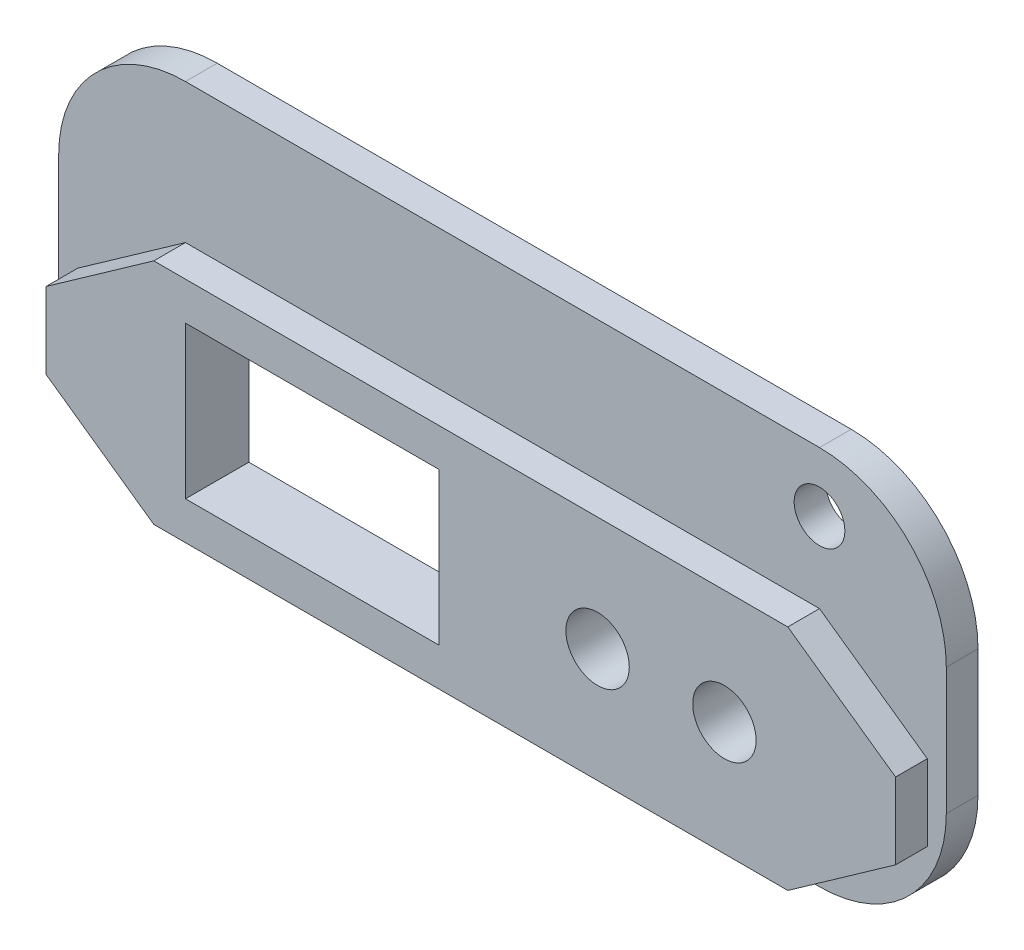
ISO-10303-21;
HEADER;
FILE_DESCRIPTION(('STEP AP214'),'2;1');
FILE_NAME('part.step','',(''),(''),'','','');
FILE_SCHEMA(('AUTOMOTIVE_DESIGN { 1 0 10303 214 1 1 1 1 }'));
ENDSEC;
DATA;
#1=APPLICATION_CONTEXT('core data for automotive mechanical design processes');
#2=APPLICATION_PROTOCOL_DEFINITION('international standard','automotive_design',2000,#1);
#3=PRODUCT_CONTEXT('',#1,'mechanical');
#4=PRODUCT('Part','Part','',(#3));
#5=PRODUCT_RELATED_PRODUCT_CATEGORY('part','',(#4));
#6=PRODUCT_DEFINITION_FORMATION('','',#4);
#7=PRODUCT_DEFINITION_CONTEXT('part definition',#1,'design');
#8=PRODUCT_DEFINITION('design','',#6,#7);
#9=PRODUCT_DEFINITION_SHAPE('','',#8);
#10=(LENGTH_UNIT() NAMED_UNIT(*) SI_UNIT(.MILLI.,.METRE.));
#11=(NAMED_UNIT(*) PLANE_ANGLE_UNIT() SI_UNIT($,.RADIAN.));
#12=(NAMED_UNIT(*) SI_UNIT($,.STERADIAN.) SOLID_ANGLE_UNIT());
#13=UNCERTAINTY_MEASURE_WITH_UNIT(LENGTH_MEASURE(1.E-05),#10,'distance_accuracy_value','');
#14=(GEOMETRIC_REPRESENTATION_CONTEXT(3) GLOBAL_UNCERTAINTY_ASSIGNED_CONTEXT((#13)) GLOBAL_UNIT_ASSIGNED_CONTEXT((#10,
#11,#12)) REPRESENTATION_CONTEXT('',''));
#15=CARTESIAN_POINT('',(0.,0.,0.));
#16=DIRECTION('',(0.,0.,1.));
#17=DIRECTION('',(1.,0.,0.));
#18=AXIS2_PLACEMENT_3D('',#15,#16,#17);
#19=CARTESIAN_POINT('',(-33.5,3.,2.5));
#20=DIRECTION('',(1.,0.,0.));
#21=DIRECTION('',(0.,1.,0.));
#22=AXIS2_PLACEMENT_3D('',#19,#20,#21);
#23=PLANE('',#22);
#24=DIRECTION('',(0.,-1.,0.));
#25=VECTOR('',#24,1.);
#26=CARTESIAN_POINT('',(-33.5,3.,0.));
#27=LINE('',#26,#25);
#28=CARTESIAN_POINT('',(-33.5,3.,0.));
#29=VERTEX_POINT('',#28);
#30=CARTESIAN_POINT('',(-33.5,-3.,0.));
#31=VERTEX_POINT('',#30);
#32=EDGE_CURVE('E268',#29,#31,#27,.T.);
#33=ORIENTED_EDGE('',*,*,#32,.T.);
#34=DIRECTION('',(0.,0.,-1.));
#35=VECTOR('',#34,1.);
#36=CARTESIAN_POINT('',(-33.5,-3.,2.5));
#37=LINE('',#36,#35);
#38=CARTESIAN_POINT('',(-33.5,-3.,2.5));
#39=VERTEX_POINT('',#38);
#40=EDGE_CURVE('E367',#39,#31,#37,.T.);
#41=ORIENTED_EDGE('',*,*,#40,.F.);
#42=DIRECTION('',(0.,-1.,0.));
#43=VECTOR('',#42,1.);
#44=CARTESIAN_POINT('',(-33.5,3.,2.5));
#45=LINE('',#44,#43);
#46=CARTESIAN_POINT('',(-33.5,3.,2.5));
#47=VERTEX_POINT('',#46);
#48=EDGE_CURVE('E283',#47,#39,#45,.T.);
#49=ORIENTED_EDGE('',*,*,#48,.F.);
#50=DIRECTION('',(0.,0.,-1.));
#51=VECTOR('',#50,1.);
#52=CARTESIAN_POINT('',(-33.5,3.,2.5));
#53=LINE('',#52,#51);
#54=EDGE_CURVE('E309',#47,#29,#53,.T.);
#55=ORIENTED_EDGE('',*,*,#54,.T.);
#56=EDGE_LOOP('',(#33,#41,#49,#55));
#57=FACE_BOUND('',#56,.T.);
#58=ADVANCED_FACE('F42',(#57),#23,.F.);
#59=CARTESIAN_POINT('',(-33.5,-3.,2.5));
#60=DIRECTION('',(0.576683197598655,0.816967863264762,0.));
#61=DIRECTION('',(-0.816967863264762,0.576683197598655,0.));
#62=AXIS2_PLACEMENT_3D('',#59,#60,#61);
#63=PLANE('',#62);
#64=DIRECTION('',(0.816967863264762,-0.576683197598655,0.));
#65=VECTOR('',#64,1.);
#66=CARTESIAN_POINT('',(-33.5,-3.,0.));
#67=LINE('',#66,#65);
#68=CARTESIAN_POINT('',(-25.,-9.,0.));
#69=VERTEX_POINT('',#68);
#70=EDGE_CURVE('E313',#31,#69,#67,.T.);
#71=ORIENTED_EDGE('',*,*,#70,.T.);
#72=DIRECTION('',(0.,0.,-1.));
#73=VECTOR('',#72,1.);
#74=CARTESIAN_POINT('',(-25.,-9.,2.5));
#75=LINE('',#74,#73);
#76=CARTESIAN_POINT('',(-25.,-9.,2.5));
#77=VERTEX_POINT('',#76);
#78=EDGE_CURVE('E363',#77,#69,#75,.T.);
#79=ORIENTED_EDGE('',*,*,#78,.F.);
#80=DIRECTION('',(0.816967863264762,-0.576683197598655,0.));
#81=VECTOR('',#80,1.);
#82=CARTESIAN_POINT('',(-33.5,-3.,2.5));
#83=LINE('',#82,#81);
#84=EDGE_CURVE('E287',#39,#77,#83,.T.);
#85=ORIENTED_EDGE('',*,*,#84,.F.);
#86=ORIENTED_EDGE('',*,*,#40,.T.);
#87=EDGE_LOOP('',(#71,#79,#85,#86));
#88=FACE_BOUND('',#87,.T.);
#89=ADVANCED_FACE('F467',(#88),#63,.F.);
#90=CARTESIAN_POINT('',(-25.,-9.,2.5));
#91=DIRECTION('',(0.,1.,0.));
#92=DIRECTION('',(0.,0.,1.));
#93=AXIS2_PLACEMENT_3D('',#90,#91,#92);
#94=PLANE('',#93);
#95=DIRECTION('',(1.,0.,0.));
#96=VECTOR('',#95,1.);
#97=CARTESIAN_POINT('',(-25.,-9.,0.));
#98=LINE('',#97,#96);
#99=CARTESIAN_POINT('',(25.,-9.,0.));
#100=VERTEX_POINT('',#99);
#101=EDGE_CURVE('E317',#69,#100,#98,.T.);
#102=ORIENTED_EDGE('',*,*,#101,.T.);
#103=DIRECTION('',(0.,0.,-1.));
#104=VECTOR('',#103,1.);
#105=CARTESIAN_POINT('',(25.,-9.,2.5));
#106=LINE('',#105,#104);
#107=CARTESIAN_POINT('',(25.,-9.,2.5));
#108=VERTEX_POINT('',#107);
#109=EDGE_CURVE('E359',#108,#100,#106,.T.);
#110=ORIENTED_EDGE('',*,*,#109,.F.);
#111=DIRECTION('',(1.,0.,0.));
#112=VECTOR('',#111,1.);
#113=CARTESIAN_POINT('',(-25.,-9.,2.5));
#114=LINE('',#113,#112);
#115=EDGE_CURVE('E291',#77,#108,#114,.T.);
#116=ORIENTED_EDGE('',*,*,#115,.F.);
#117=ORIENTED_EDGE('',*,*,#78,.T.);
#118=EDGE_LOOP('',(#102,#110,#116,#117));
#119=FACE_BOUND('',#118,.T.);
#120=ADVANCED_FACE('F473',(#119),#94,.F.);
#121=CARTESIAN_POINT('',(25.,-9.,2.5));
#122=DIRECTION('',(-0.576683197598656,0.816967863264762,0.));
#123=DIRECTION('',(-0.816967863264762,-0.576683197598656,0.));
#124=AXIS2_PLACEMENT_3D('',#121,#122,#123);
#125=PLANE('',#124);
#126=DIRECTION('',(0.816967863264762,0.576683197598656,0.));
#127=VECTOR('',#126,1.);
#128=CARTESIAN_POINT('',(25.,-9.,0.));
#129=LINE('',#128,#127);
#130=CARTESIAN_POINT('',(33.5,-3.,0.));
#131=VERTEX_POINT('',#130);
#132=EDGE_CURVE('E321',#100,#131,#129,.T.);
#133=ORIENTED_EDGE('',*,*,#132,.T.);
#134=DIRECTION('',(0.,0.,-1.));
#135=VECTOR('',#134,1.);
#136=CARTESIAN_POINT('',(33.5,-3.,2.5));
#137=LINE('',#136,#135);
#138=CARTESIAN_POINT('',(33.5,-3.,2.5));
#139=VERTEX_POINT('',#138);
#140=EDGE_CURVE('E355',#139,#131,#137,.T.);
#141=ORIENTED_EDGE('',*,*,#140,.F.);
#142=DIRECTION('',(0.816967863264762,0.576683197598656,0.));
#143=VECTOR('',#142,1.);
#144=CARTESIAN_POINT('',(25.,-9.,2.5));
#145=LINE('',#144,#143);
#146=EDGE_CURVE('E294',#108,#139,#145,.T.);
#147=ORIENTED_EDGE('',*,*,#146,.F.);
#148=ORIENTED_EDGE('',*,*,#109,.T.);
#149=EDGE_LOOP('',(#133,#141,#147,#148));
#150=FACE_BOUND('',#149,.T.);
#151=ADVANCED_FACE('F680',(#150),#125,.F.);
#152=CARTESIAN_POINT('',(33.5,3.,2.5));
#153=DIRECTION('',(-1.,0.,0.));
#154=DIRECTION('',(0.,0.,1.));
#155=AXIS2_PLACEMENT_3D('',#152,#153,#154);
#156=PLANE('',#155);
#157=DIRECTION('',(0.,1.,0.));
#158=VECTOR('',#157,1.);
#159=CARTESIAN_POINT('',(33.5,3.,0.));
#160=LINE('',#159,#158);
#161=CARTESIAN_POINT('',(33.5,3.,0.));
#162=VERTEX_POINT('',#161);
#163=EDGE_CURVE('E325',#131,#162,#160,.T.);
#164=ORIENTED_EDGE('',*,*,#163,.T.);
#165=DIRECTION('',(0.,0.,-1.));
#166=VECTOR('',#165,1.);
#167=CARTESIAN_POINT('',(33.5,3.,2.5));
#168=LINE('',#167,#166);
#169=CARTESIAN_POINT('',(33.5,3.,2.5));
#170=VERTEX_POINT('',#169);
#171=EDGE_CURVE('E351',#170,#162,#168,.T.);
#172=ORIENTED_EDGE('',*,*,#171,.F.);
#173=DIRECTION('',(0.,1.,0.));
#174=VECTOR('',#173,1.);
#175=CARTESIAN_POINT('',(33.5,3.,2.5));
#176=LINE('',#175,#174);
#177=EDGE_CURVE('E297',#139,#170,#176,.T.);
#178=ORIENTED_EDGE('',*,*,#177,.F.);
#179=ORIENTED_EDGE('',*,*,#140,.T.);
#180=EDGE_LOOP('',(#164,#172,#178,#179));
#181=FACE_BOUND('',#180,.T.);
#182=ADVANCED_FACE('F670',(#181),#156,.F.);
#183=CARTESIAN_POINT('',(25.,9.,2.5));
#184=DIRECTION('',(-0.576683197598656,-0.816967863264761,0.));
#185=DIRECTION('',(0.816967863264761,-0.576683197598656,0.));
#186=AXIS2_PLACEMENT_3D('',#183,#184,#185);
#187=PLANE('',#186);
#188=DIRECTION('',(-0.816967863264761,0.576683197598656,0.));
#189=VECTOR('',#188,1.);
#190=CARTESIAN_POINT('',(25.,9.,0.));
#191=LINE('',#190,#189);
#192=CARTESIAN_POINT('',(25.,9.,0.));
#193=VERTEX_POINT('',#192);
#194=EDGE_CURVE('E329',#162,#193,#191,.T.);
#195=ORIENTED_EDGE('',*,*,#194,.T.);
#196=DIRECTION('',(0.,0.,-1.));
#197=VECTOR('',#196,1.);
#198=CARTESIAN_POINT('',(25.,9.,2.5));
#199=LINE('',#198,#197);
#200=CARTESIAN_POINT('',(25.,9.,2.5));
#201=VERTEX_POINT('',#200);
#202=EDGE_CURVE('E347',#201,#193,#199,.T.);
#203=ORIENTED_EDGE('',*,*,#202,.F.);
#204=DIRECTION('',(-0.816967863264761,0.576683197598656,0.));
#205=VECTOR('',#204,1.);
#206=CARTESIAN_POINT('',(25.,9.,2.5));
#207=LINE('',#206,#205);
#208=EDGE_CURVE('E300',#170,#201,#207,.T.);
#209=ORIENTED_EDGE('',*,*,#208,.F.);
#210=ORIENTED_EDGE('',*,*,#171,.T.);
#211=EDGE_LOOP('',(#195,#203,#209,#210));
#212=FACE_BOUND('',#211,.T.);
#213=ADVANCED_FACE('F660',(#212),#187,.F.);
#214=CARTESIAN_POINT('',(-25.,9.,2.5));
#215=DIRECTION('',(0.,-1.,0.));
#216=DIRECTION('',(1.,0.,0.));
#217=AXIS2_PLACEMENT_3D('',#214,#215,#216);
#218=PLANE('',#217);
#219=DIRECTION('',(-1.,0.,0.));
#220=VECTOR('',#219,1.);
#221=CARTESIAN_POINT('',(-25.,9.,0.));
#222=LINE('',#221,#220);
#223=CARTESIAN_POINT('',(-25.,9.,0.));
#224=VERTEX_POINT('',#223);
#225=EDGE_CURVE('E333',#193,#224,#222,.T.);
#226=ORIENTED_EDGE('',*,*,#225,.T.);
#227=DIRECTION('',(0.,0.,-1.));
#228=VECTOR('',#227,1.);
#229=CARTESIAN_POINT('',(-25.,9.,2.5));
#230=LINE('',#229,#228);
#231=CARTESIAN_POINT('',(-25.,9.,2.5));
#232=VERTEX_POINT('',#231);
#233=EDGE_CURVE('E343',#232,#224,#230,.T.);
#234=ORIENTED_EDGE('',*,*,#233,.F.);
#235=DIRECTION('',(-1.,0.,0.));
#236=VECTOR('',#235,1.);
#237=CARTESIAN_POINT('',(-25.,9.,2.5));
#238=LINE('',#237,#236);
#239=EDGE_CURVE('E303',#201,#232,#238,.T.);
#240=ORIENTED_EDGE('',*,*,#239,.F.);
#241=ORIENTED_EDGE('',*,*,#202,.T.);
#242=EDGE_LOOP('',(#226,#234,#240,#241));
#243=FACE_BOUND('',#242,.T.);
#244=ADVANCED_FACE('F650',(#243),#218,.F.);
#245=CARTESIAN_POINT('',(-33.5,3.,2.5));
#246=DIRECTION('',(0.576683197598655,-0.816967863264762,0.));
#247=DIRECTION('',(0.816967863264762,0.576683197598655,0.));
#248=AXIS2_PLACEMENT_3D('',#245,#246,#247);
#249=PLANE('',#248);
#250=DIRECTION('',(-0.816967863264762,-0.576683197598655,0.));
#251=VECTOR('',#250,1.);
#252=CARTESIAN_POINT('',(-33.5,3.,0.));
#253=LINE('',#252,#251);
#254=EDGE_CURVE('E288',#224,#29,#253,.T.);
#255=ORIENTED_EDGE('',*,*,#254,.T.);
#256=ORIENTED_EDGE('',*,*,#54,.F.);
#257=DIRECTION('',(-0.816967863264762,-0.576683197598655,0.));
#258=VECTOR('',#257,1.);
#259=CARTESIAN_POINT('',(-33.5,3.,2.5));
#260=LINE('',#259,#258);
#261=EDGE_CURVE('E306',#232,#47,#260,.T.);
#262=ORIENTED_EDGE('',*,*,#261,.F.);
#263=ORIENTED_EDGE('',*,*,#233,.T.);
#264=EDGE_LOOP('',(#255,#256,#262,#263));
#265=FACE_BOUND('',#264,.T.);
#266=ADVANCED_FACE('F507',(#265),#249,.F.);
#267=CARTESIAN_POINT('',(0.,0.,2.5));
#268=DIRECTION('',(0.,0.,1.));
#269=DIRECTION('',(1.,0.,0.));
#270=AXIS2_PLACEMENT_3D('',#267,#268,#269);
#271=PLANE('',#270);
#272=DIRECTION('',(0.,1.,0.));
#273=VECTOR('',#272,1.);
#274=CARTESIAN_POINT('',(-2.5,6.,2.5));
#275=LINE('',#274,#273);
#276=CARTESIAN_POINT('',(-2.5,-6.,2.5));
#277=VERTEX_POINT('',#276);
#278=CARTESIAN_POINT('',(-2.5,6.,2.5));
#279=VERTEX_POINT('',#278);
#280=EDGE_CURVE('E58',#277,#279,#275,.T.);
#281=ORIENTED_EDGE('',*,*,#280,.F.);
#282=DIRECTION('',(1.,0.,0.));
#283=VECTOR('',#282,1.);
#284=CARTESIAN_POINT('',(-22.5,-6.,2.5));
#285=LINE('',#284,#283);
#286=CARTESIAN_POINT('',(-22.5,-6.,2.5));
#287=VERTEX_POINT('',#286);
#288=EDGE_CURVE('E199',#287,#277,#285,.T.);
#289=ORIENTED_EDGE('',*,*,#288,.F.);
#290=DIRECTION('',(0.,-1.,0.));
#291=VECTOR('',#290,1.);
#292=CARTESIAN_POINT('',(-22.5,6.,2.5));
#293=LINE('',#292,#291);
#294=CARTESIAN_POINT('',(-22.5,6.,2.5));
#295=VERTEX_POINT('',#294);
#296=EDGE_CURVE('E181',#295,#287,#293,.T.);
#297=ORIENTED_EDGE('',*,*,#296,.F.);
#298=DIRECTION('',(-1.,0.,0.));
#299=VECTOR('',#298,1.);
#300=CARTESIAN_POINT('',(-22.5,6.,2.5));
#301=LINE('',#300,#299);
#302=EDGE_CURVE('E191',#279,#295,#301,.T.);
#303=ORIENTED_EDGE('',*,*,#302,.F.);
#304=EDGE_LOOP('',(#281,#289,#297,#303));
#305=FACE_BOUND('',#304,.T.);
#306=CARTESIAN_POINT('',(10.,0.,2.5));
#307=DIRECTION('',(0.,0.,1.));
#308=DIRECTION('',(1.,0.,0.));
#309=AXIS2_PLACEMENT_3D('',#306,#307,#308);
#310=CIRCLE('',#309,2.5);
#311=CARTESIAN_POINT('',(12.5,0.,2.5));
#312=VERTEX_POINT('',#311);
#313=EDGE_CURVE('E231',#312,#312,#310,.T.);
#314=ORIENTED_EDGE('',*,*,#313,.F.);
#315=EDGE_LOOP('',(#314));
#316=FACE_BOUND('',#315,.T.);
#317=CARTESIAN_POINT('',(20.,0.,2.5));
#318=DIRECTION('',(0.,0.,1.));
#319=DIRECTION('',(1.,0.,0.));
#320=AXIS2_PLACEMENT_3D('',#317,#318,#319);
#321=CIRCLE('',#320,2.5);
#322=CARTESIAN_POINT('',(22.5,0.,2.5));
#323=VERTEX_POINT('',#322);
#324=EDGE_CURVE('E232',#323,#323,#321,.T.);
#325=ORIENTED_EDGE('',*,*,#324,.F.);
#326=EDGE_LOOP('',(#325));
#327=FACE_BOUND('',#326,.T.);
#328=ORIENTED_EDGE('',*,*,#48,.T.);
#329=ORIENTED_EDGE('',*,*,#84,.T.);
#330=ORIENTED_EDGE('',*,*,#115,.T.);
#331=ORIENTED_EDGE('',*,*,#146,.T.);
#332=ORIENTED_EDGE('',*,*,#177,.T.);
#333=ORIENTED_EDGE('',*,*,#208,.T.);
#334=ORIENTED_EDGE('',*,*,#239,.T.);
#335=ORIENTED_EDGE('',*,*,#261,.T.);
#336=EDGE_LOOP('',(#328,#329,#330,#331,#332,#333,#334,#335));
#337=FACE_BOUND('',#336,.T.);
#338=ADVANCED_FACE('F196',(#305,#316,#327,#337),#271,.T.);
#339=CARTESIAN_POINT('',(0.,0.,0.));
#340=DIRECTION('',(0.,0.,1.));
#341=DIRECTION('',(1.,0.,0.));
#342=AXIS2_PLACEMENT_3D('',#339,#340,#341);
#343=PLANE('',#342);
#344=CARTESIAN_POINT('',(25.,15.3,0.));
#345=DIRECTION('',(0.,0.,1.));
#346=DIRECTION('',(1.,0.,0.));
#347=AXIS2_PLACEMENT_3D('',#344,#345,#346);
#348=CIRCLE('',#347,2.);
#349=CARTESIAN_POINT('',(27.,15.3,0.));
#350=VERTEX_POINT('',#349);
#351=EDGE_CURVE('E222',#350,#350,#348,.T.);
#352=ORIENTED_EDGE('',*,*,#351,.F.);
#353=EDGE_LOOP('',(#352));
#354=FACE_BOUND('',#353,.T.);
#355=DIRECTION('',(0.,-1.,0.));
#356=VECTOR('',#355,1.);
#357=CARTESIAN_POINT('',(-35.,20.,0.));
#358=LINE('',#357,#356);
#359=CARTESIAN_POINT('',(-35.,10.,0.));
#360=VERTEX_POINT('',#359);
#361=CARTESIAN_POINT('',(-35.,0.,0.));
#362=VERTEX_POINT('',#361);
#363=EDGE_CURVE('E276',#360,#362,#358,.T.);
#364=ORIENTED_EDGE('',*,*,#363,.T.);
#365=CARTESIAN_POINT('',(-25.,0.,0.));
#366=DIRECTION('',(0.,0.,1.));
#367=DIRECTION('',(1.,0.,0.));
#368=AXIS2_PLACEMENT_3D('',#365,#366,#367);
#369=CIRCLE('',#368,10.);
#370=CARTESIAN_POINT('',(-25.,-10.,0.));
#371=VERTEX_POINT('',#370);
#372=EDGE_CURVE('E387',#362,#371,#369,.T.);
#373=ORIENTED_EDGE('',*,*,#372,.T.);
#374=DIRECTION('',(1.,0.,0.));
#375=VECTOR('',#374,1.);
#376=CARTESIAN_POINT('',(-35.,-10.,0.));
#377=LINE('',#376,#375);
#378=CARTESIAN_POINT('',(25.,-10.,0.));
#379=VERTEX_POINT('',#378);
#380=EDGE_CURVE('E256',#371,#379,#377,.T.);
#381=ORIENTED_EDGE('',*,*,#380,.T.);
#382=CARTESIAN_POINT('',(25.,0.,0.));
#383=DIRECTION('',(0.,0.,1.));
#384=DIRECTION('',(1.,0.,0.));
#385=AXIS2_PLACEMENT_3D('',#382,#383,#384);
#386=CIRCLE('',#385,10.);
#387=CARTESIAN_POINT('',(35.,0.,0.));
#388=VERTEX_POINT('',#387);
#389=EDGE_CURVE('E384',#379,#388,#386,.T.);
#390=ORIENTED_EDGE('',*,*,#389,.T.);
#391=DIRECTION('',(0.,1.,0.));
#392=VECTOR('',#391,1.);
#393=CARTESIAN_POINT('',(35.,20.,0.));
#394=LINE('',#393,#392);
#395=CARTESIAN_POINT('',(35.,10.,0.));
#396=VERTEX_POINT('',#395);
#397=EDGE_CURVE('E247',#388,#396,#394,.T.);
#398=ORIENTED_EDGE('',*,*,#397,.T.);
#399=CARTESIAN_POINT('',(25.,10.,0.));
#400=DIRECTION('',(0.,0.,1.));
#401=DIRECTION('',(1.,0.,0.));
#402=AXIS2_PLACEMENT_3D('',#399,#400,#401);
#403=CIRCLE('',#402,10.);
#404=CARTESIAN_POINT('',(25.,20.,0.));
#405=VERTEX_POINT('',#404);
#406=EDGE_CURVE('E381',#396,#405,#403,.T.);
#407=ORIENTED_EDGE('',*,*,#406,.T.);
#408=DIRECTION('',(-1.,0.,0.));
#409=VECTOR('',#408,1.);
#410=CARTESIAN_POINT('',(-35.,20.,0.));
#411=LINE('',#410,#409);
#412=CARTESIAN_POINT('',(-25.,20.,0.));
#413=VERTEX_POINT('',#412);
#414=EDGE_CURVE('E272',#405,#413,#411,.T.);
#415=ORIENTED_EDGE('',*,*,#414,.T.);
#416=CARTESIAN_POINT('',(-25.,10.,0.));
#417=DIRECTION('',(0.,0.,1.));
#418=DIRECTION('',(1.,0.,0.));
#419=AXIS2_PLACEMENT_3D('',#416,#417,#418);
#420=CIRCLE('',#419,10.);
#421=EDGE_CURVE('E378',#413,#360,#420,.T.);
#422=ORIENTED_EDGE('',*,*,#421,.T.);
#423=EDGE_LOOP('',(#364,#373,#381,#390,#398,#407,#415,#422));
#424=FACE_BOUND('',#423,.T.);
#425=ORIENTED_EDGE('',*,*,#32,.F.);
#426=ORIENTED_EDGE('',*,*,#254,.F.);
#427=ORIENTED_EDGE('',*,*,#225,.F.);
#428=ORIENTED_EDGE('',*,*,#194,.F.);
#429=ORIENTED_EDGE('',*,*,#163,.F.);
#430=ORIENTED_EDGE('',*,*,#132,.F.);
#431=ORIENTED_EDGE('',*,*,#101,.F.);
#432=ORIENTED_EDGE('',*,*,#70,.F.);
#433=EDGE_LOOP('',(#425,#426,#427,#428,#429,#430,#431,#432));
#434=FACE_BOUND('',#433,.T.);
#435=ADVANCED_FACE('F426',(#354,#424,#434),#343,.T.);
#436=CARTESIAN_POINT('',(35.,20.,-2.5));
#437=DIRECTION('',(1.,0.,0.));
#438=DIRECTION('',(0.,1.,0.));
#439=AXIS2_PLACEMENT_3D('',#436,#437,#438);
#440=PLANE('',#439);
#441=ORIENTED_EDGE('',*,*,#397,.F.);
#442=DIRECTION('',(0.,0.,1.));
#443=VECTOR('',#442,1.);
#444=CARTESIAN_POINT('',(35.,0.,-2.5));
#445=LINE('',#444,#443);
#446=CARTESIAN_POINT('',(35.,0.,-2.5));
#447=VERTEX_POINT('',#446);
#448=EDGE_CURVE('E413',#388,#447,#445,.F.);
#449=ORIENTED_EDGE('',*,*,#448,.T.);
#450=DIRECTION('',(0.,1.,0.));
#451=VECTOR('',#450,1.);
#452=CARTESIAN_POINT('',(35.,20.,-2.5));
#453=LINE('',#452,#451);
#454=CARTESIAN_POINT('',(35.,10.,-2.5));
#455=VERTEX_POINT('',#454);
#456=EDGE_CURVE('E251',#447,#455,#453,.T.);
#457=ORIENTED_EDGE('',*,*,#456,.T.);
#458=DIRECTION('',(0.,0.,1.));
#459=VECTOR('',#458,1.);
#460=CARTESIAN_POINT('',(35.,10.,-2.5));
#461=LINE('',#460,#459);
#462=EDGE_CURVE('E409',#455,#396,#461,.T.);
#463=ORIENTED_EDGE('',*,*,#462,.T.);
#464=EDGE_LOOP('',(#441,#449,#457,#463));
#465=FACE_BOUND('',#464,.T.);
#466=ADVANCED_FACE('F435',(#465),#440,.T.);
#467=CARTESIAN_POINT('',(-35.,-10.,-2.5));
#468=DIRECTION('',(0.,-1.,0.));
#469=DIRECTION('',(1.,0.,0.));
#470=AXIS2_PLACEMENT_3D('',#467,#468,#469);
#471=PLANE('',#470);
#472=ORIENTED_EDGE('',*,*,#380,.F.);
#473=DIRECTION('',(0.,0.,1.));
#474=VECTOR('',#473,1.);
#475=CARTESIAN_POINT('',(-25.,-10.,-2.5));
#476=LINE('',#475,#474);
#477=CARTESIAN_POINT('',(-25.,-10.,-2.5));
#478=VERTEX_POINT('',#477);
#479=EDGE_CURVE('E394',#371,#478,#476,.F.);
#480=ORIENTED_EDGE('',*,*,#479,.T.);
#481=DIRECTION('',(1.,0.,0.));
#482=VECTOR('',#481,1.);
#483=CARTESIAN_POINT('',(-35.,-10.,-2.5));
#484=LINE('',#483,#482);
#485=CARTESIAN_POINT('',(25.,-10.,-2.5));
#486=VERTEX_POINT('',#485);
#487=EDGE_CURVE('E264',#478,#486,#484,.T.);
#488=ORIENTED_EDGE('',*,*,#487,.T.);
#489=DIRECTION('',(0.,0.,1.));
#490=VECTOR('',#489,1.);
#491=CARTESIAN_POINT('',(25.,-10.,-2.5));
#492=LINE('',#491,#490);
#493=EDGE_CURVE('E390',#486,#379,#492,.T.);
#494=ORIENTED_EDGE('',*,*,#493,.T.);
#495=EDGE_LOOP('',(#472,#480,#488,#494));
#496=FACE_BOUND('',#495,.T.);
#497=ADVANCED_FACE('F447',(#496),#471,.T.);
#498=CARTESIAN_POINT('',(-35.,20.,-2.5));
#499=DIRECTION('',(-1.,0.,0.));
#500=DIRECTION('',(0.,0.,1.));
#501=AXIS2_PLACEMENT_3D('',#498,#499,#500);
#502=PLANE('',#501);
#503=DIRECTION('',(0.,-1.,0.));
#504=VECTOR('',#503,1.);
#505=CARTESIAN_POINT('',(-35.,20.,-2.5));
#506=LINE('',#505,#504);
#507=CARTESIAN_POINT('',(-35.,10.,-2.5));
#508=VERTEX_POINT('',#507);
#509=CARTESIAN_POINT('',(-35.,0.,-2.5));
#510=VERTEX_POINT('',#509);
#511=EDGE_CURVE('E260',#508,#510,#506,.T.);
#512=ORIENTED_EDGE('',*,*,#511,.T.);
#513=DIRECTION('',(0.,0.,1.));
#514=VECTOR('',#513,1.);
#515=CARTESIAN_POINT('',(-35.,0.,-2.5));
#516=LINE('',#515,#514);
#517=EDGE_CURVE('E374',#510,#362,#516,.T.);
#518=ORIENTED_EDGE('',*,*,#517,.T.);
#519=ORIENTED_EDGE('',*,*,#363,.F.);
#520=DIRECTION('',(0.,0.,1.));
#521=VECTOR('',#520,1.);
#522=CARTESIAN_POINT('',(-35.,10.,-2.5));
#523=LINE('',#522,#521);
#524=EDGE_CURVE('E371',#360,#508,#523,.F.);
#525=ORIENTED_EDGE('',*,*,#524,.T.);
#526=EDGE_LOOP('',(#512,#518,#519,#525));
#527=FACE_BOUND('',#526,.T.);
#528=ADVANCED_FACE('F454',(#527),#502,.T.);
#529=CARTESIAN_POINT('',(-35.,20.,-2.5));
#530=DIRECTION('',(0.,1.,0.));
#531=DIRECTION('',(0.,0.,1.));
#532=AXIS2_PLACEMENT_3D('',#529,#530,#531);
#533=PLANE('',#532);
#534=ORIENTED_EDGE('',*,*,#414,.F.);
#535=DIRECTION('',(0.,0.,1.));
#536=VECTOR('',#535,1.);
#537=CARTESIAN_POINT('',(25.,20.,-2.5));
#538=LINE('',#537,#536);
#539=CARTESIAN_POINT('',(25.,20.,-2.5));
#540=VERTEX_POINT('',#539);
#541=EDGE_CURVE('E11',#405,#540,#538,.F.);
#542=ORIENTED_EDGE('',*,*,#541,.T.);
#543=DIRECTION('',(-1.,0.,0.));
#544=VECTOR('',#543,1.);
#545=CARTESIAN_POINT('',(-35.,20.,-2.5));
#546=LINE('',#545,#544);
#547=CARTESIAN_POINT('',(-25.,20.,-2.5));
#548=VERTEX_POINT('',#547);
#549=EDGE_CURVE('E255',#540,#548,#546,.T.);
#550=ORIENTED_EDGE('',*,*,#549,.T.);
#551=DIRECTION('',(0.,0.,1.));
#552=VECTOR('',#551,1.);
#553=CARTESIAN_POINT('',(-25.,20.,-2.5));
#554=LINE('',#553,#552);
#555=EDGE_CURVE('E51',#548,#413,#554,.T.);
#556=ORIENTED_EDGE('',*,*,#555,.T.);
#557=EDGE_LOOP('',(#534,#542,#550,#556));
#558=FACE_BOUND('',#557,.T.);
#559=ADVANCED_FACE('F420',(#558),#533,.T.);
#560=CARTESIAN_POINT('',(0.,0.,-2.5));
#561=DIRECTION('',(0.,0.,1.));
#562=DIRECTION('',(1.,0.,0.));
#563=AXIS2_PLACEMENT_3D('',#560,#561,#562);
#564=PLANE('',#563);
#565=DIRECTION('',(1.,0.,0.));
#566=VECTOR('',#565,1.);
#567=CARTESIAN_POINT('',(-22.5,-6.,-2.5));
#568=LINE('',#567,#566);
#569=CARTESIAN_POINT('',(-22.5,-6.,-2.5));
#570=VERTEX_POINT('',#569);
#571=CARTESIAN_POINT('',(-2.5,-6.,-2.5));
#572=VERTEX_POINT('',#571);
#573=EDGE_CURVE('E215',#570,#572,#568,.T.);
#574=ORIENTED_EDGE('',*,*,#573,.T.);
#575=DIRECTION('',(0.,1.,0.));
#576=VECTOR('',#575,1.);
#577=CARTESIAN_POINT('',(-2.5,6.,-2.5));
#578=LINE('',#577,#576);
#579=CARTESIAN_POINT('',(-2.5,6.,-2.5));
#580=VERTEX_POINT('',#579);
#581=EDGE_CURVE('E203',#572,#580,#578,.T.);
#582=ORIENTED_EDGE('',*,*,#581,.T.);
#583=DIRECTION('',(-1.,0.,0.));
#584=VECTOR('',#583,1.);
#585=CARTESIAN_POINT('',(-22.5,6.,-2.5));
#586=LINE('',#585,#584);
#587=CARTESIAN_POINT('',(-22.5,6.,-2.5));
#588=VERTEX_POINT('',#587);
#589=EDGE_CURVE('E210',#580,#588,#586,.T.);
#590=ORIENTED_EDGE('',*,*,#589,.T.);
#591=DIRECTION('',(0.,-1.,0.));
#592=VECTOR('',#591,1.);
#593=CARTESIAN_POINT('',(-22.5,6.,-2.5));
#594=LINE('',#593,#592);
#595=EDGE_CURVE('E66',#588,#570,#594,.T.);
#596=ORIENTED_EDGE('',*,*,#595,.T.);
#597=EDGE_LOOP('',(#574,#582,#590,#596));
#598=FACE_BOUND('',#597,.T.);
#599=CARTESIAN_POINT('',(10.,0.,-2.5));
#600=DIRECTION('',(0.,0.,1.));
#601=DIRECTION('',(1.,0.,0.));
#602=AXIS2_PLACEMENT_3D('',#599,#600,#601);
#603=CIRCLE('',#602,2.5);
#604=CARTESIAN_POINT('',(12.5,0.,-2.5));
#605=VERTEX_POINT('',#604);
#606=EDGE_CURVE('E227',#605,#605,#603,.T.);
#607=ORIENTED_EDGE('',*,*,#606,.T.);
#608=EDGE_LOOP('',(#607));
#609=FACE_BOUND('',#608,.T.);
#610=CARTESIAN_POINT('',(20.,0.,-2.5));
#611=DIRECTION('',(0.,0.,1.));
#612=DIRECTION('',(1.,0.,0.));
#613=AXIS2_PLACEMENT_3D('',#610,#611,#612);
#614=CIRCLE('',#613,2.5);
#615=CARTESIAN_POINT('',(22.5,0.,-2.5));
#616=VERTEX_POINT('',#615);
#617=EDGE_CURVE('E236',#616,#616,#614,.T.);
#618=ORIENTED_EDGE('',*,*,#617,.T.);
#619=EDGE_LOOP('',(#618));
#620=FACE_BOUND('',#619,.T.);
#621=CARTESIAN_POINT('',(25.,15.3,-2.5));
#622=DIRECTION('',(0.,0.,1.));
#623=DIRECTION('',(1.,0.,0.));
#624=AXIS2_PLACEMENT_3D('',#621,#622,#623);
#625=CIRCLE('',#624,2.);
#626=CARTESIAN_POINT('',(27.,15.3,-2.5));
#627=VERTEX_POINT('',#626);
#628=EDGE_CURVE('E243',#627,#627,#625,.T.);
#629=ORIENTED_EDGE('',*,*,#628,.T.);
#630=EDGE_LOOP('',(#629));
#631=FACE_BOUND('',#630,.T.);
#632=ORIENTED_EDGE('',*,*,#487,.F.);
#633=CARTESIAN_POINT('',(-25.,0.,-2.5));
#634=DIRECTION('',(0.,0.,1.));
#635=DIRECTION('',(1.,0.,0.));
#636=AXIS2_PLACEMENT_3D('',#633,#634,#635);
#637=CIRCLE('',#636,10.);
#638=EDGE_CURVE('E406',#478,#510,#637,.F.);
#639=ORIENTED_EDGE('',*,*,#638,.T.);
#640=ORIENTED_EDGE('',*,*,#511,.F.);
#641=CARTESIAN_POINT('',(-25.,10.,-2.5));
#642=DIRECTION('',(0.,0.,1.));
#643=DIRECTION('',(1.,0.,0.));
#644=AXIS2_PLACEMENT_3D('',#641,#642,#643);
#645=CIRCLE('',#644,10.);
#646=EDGE_CURVE('E397',#508,#548,#645,.F.);
#647=ORIENTED_EDGE('',*,*,#646,.T.);
#648=ORIENTED_EDGE('',*,*,#549,.F.);
#649=CARTESIAN_POINT('',(25.,10.,-2.5));
#650=DIRECTION('',(0.,0.,1.));
#651=DIRECTION('',(1.,0.,0.));
#652=AXIS2_PLACEMENT_3D('',#649,#650,#651);
#653=CIRCLE('',#652,10.);
#654=EDGE_CURVE('E400',#540,#455,#653,.F.);
#655=ORIENTED_EDGE('',*,*,#654,.T.);
#656=ORIENTED_EDGE('',*,*,#456,.F.);
#657=CARTESIAN_POINT('',(25.,0.,-2.5));
#658=DIRECTION('',(0.,0.,1.));
#659=DIRECTION('',(1.,0.,0.));
#660=AXIS2_PLACEMENT_3D('',#657,#658,#659);
#661=CIRCLE('',#660,10.);
#662=EDGE_CURVE('E403',#447,#486,#661,.F.);
#663=ORIENTED_EDGE('',*,*,#662,.T.);
#664=EDGE_LOOP('',(#632,#639,#640,#647,#648,#655,#656,#663));
#665=FACE_BOUND('',#664,.T.);
#666=ADVANCED_FACE('F441',(#598,#609,#620,#631,#665),#564,.F.);
#667=CARTESIAN_POINT('',(25.,15.3,-2.5));
#668=DIRECTION('',(0.,0.,1.));
#669=DIRECTION('',(1.,0.,0.));
#670=AXIS2_PLACEMENT_3D('',#667,#668,#669);
#671=CYLINDRICAL_SURFACE('',#670,2.);
#672=ORIENTED_EDGE('',*,*,#628,.F.);
#673=EDGE_LOOP('',(#672));
#674=FACE_BOUND('',#673,.T.);
#675=ORIENTED_EDGE('',*,*,#351,.T.);
#676=EDGE_LOOP('',(#675));
#677=FACE_BOUND('',#676,.T.);
#678=ADVANCED_FACE('F480',(#674,#677),#671,.F.);
#679=CARTESIAN_POINT('',(-25.,0.,-2.5));
#680=DIRECTION('',(0.,0.,1.));
#681=DIRECTION('',(1.,0.,0.));
#682=AXIS2_PLACEMENT_3D('',#679,#680,#681);
#683=CYLINDRICAL_SURFACE('',#682,10.);
#684=ORIENTED_EDGE('',*,*,#638,.F.);
#685=ORIENTED_EDGE('',*,*,#479,.F.);
#686=ORIENTED_EDGE('',*,*,#372,.F.);
#687=ORIENTED_EDGE('',*,*,#517,.F.);
#688=EDGE_LOOP('',(#684,#685,#686,#687));
#689=FACE_BOUND('',#688,.T.);
#690=ADVANCED_FACE('F452',(#689),#683,.T.);
#691=CARTESIAN_POINT('',(25.,0.,-2.5));
#692=DIRECTION('',(0.,0.,1.));
#693=DIRECTION('',(1.,0.,0.));
#694=AXIS2_PLACEMENT_3D('',#691,#692,#693);
#695=CYLINDRICAL_SURFACE('',#694,10.);
#696=ORIENTED_EDGE('',*,*,#662,.F.);
#697=ORIENTED_EDGE('',*,*,#448,.F.);
#698=ORIENTED_EDGE('',*,*,#389,.F.);
#699=ORIENTED_EDGE('',*,*,#493,.F.);
#700=EDGE_LOOP('',(#696,#697,#698,#699));
#701=FACE_BOUND('',#700,.T.);
#702=ADVANCED_FACE('F444',(#701),#695,.T.);
#703=CARTESIAN_POINT('',(25.,10.,-2.5));
#704=DIRECTION('',(0.,0.,1.));
#705=DIRECTION('',(1.,0.,0.));
#706=AXIS2_PLACEMENT_3D('',#703,#704,#705);
#707=CYLINDRICAL_SURFACE('',#706,10.);
#708=ORIENTED_EDGE('',*,*,#654,.F.);
#709=ORIENTED_EDGE('',*,*,#541,.F.);
#710=ORIENTED_EDGE('',*,*,#406,.F.);
#711=ORIENTED_EDGE('',*,*,#462,.F.);
#712=EDGE_LOOP('',(#708,#709,#710,#711));
#713=FACE_BOUND('',#712,.T.);
#714=ADVANCED_FACE('F433',(#713),#707,.T.);
#715=CARTESIAN_POINT('',(-25.,10.,-2.5));
#716=DIRECTION('',(0.,0.,1.));
#717=DIRECTION('',(1.,0.,0.));
#718=AXIS2_PLACEMENT_3D('',#715,#716,#717);
#719=CYLINDRICAL_SURFACE('',#718,10.);
#720=ORIENTED_EDGE('',*,*,#646,.F.);
#721=ORIENTED_EDGE('',*,*,#524,.F.);
#722=ORIENTED_EDGE('',*,*,#421,.F.);
#723=ORIENTED_EDGE('',*,*,#555,.F.);
#724=EDGE_LOOP('',(#720,#721,#722,#723));
#725=FACE_BOUND('',#724,.T.);
#726=ADVANCED_FACE('F44',(#725),#719,.T.);
#727=CARTESIAN_POINT('',(20.,0.,-2.5));
#728=DIRECTION('',(0.,0.,1.));
#729=DIRECTION('',(1.,0.,0.));
#730=AXIS2_PLACEMENT_3D('',#727,#728,#729);
#731=CYLINDRICAL_SURFACE('',#730,2.5);
#732=ORIENTED_EDGE('',*,*,#617,.F.);
#733=EDGE_LOOP('',(#732));
#734=FACE_BOUND('',#733,.T.);
#735=ORIENTED_EDGE('',*,*,#324,.T.);
#736=EDGE_LOOP('',(#735));
#737=FACE_BOUND('',#736,.T.);
#738=ADVANCED_FACE('F458',(#734,#737),#731,.F.);
#739=CARTESIAN_POINT('',(10.,0.,-2.5));
#740=DIRECTION('',(0.,0.,1.));
#741=DIRECTION('',(1.,0.,0.));
#742=AXIS2_PLACEMENT_3D('',#739,#740,#741);
#743=CYLINDRICAL_SURFACE('',#742,2.5);
#744=ORIENTED_EDGE('',*,*,#606,.F.);
#745=EDGE_LOOP('',(#744));
#746=FACE_BOUND('',#745,.T.);
#747=ORIENTED_EDGE('',*,*,#313,.T.);
#748=EDGE_LOOP('',(#747));
#749=FACE_BOUND('',#748,.T.);
#750=ADVANCED_FACE('F463',(#746,#749),#743,.F.);
#751=CARTESIAN_POINT('',(-2.5,6.,-2.5));
#752=DIRECTION('',(1.,0.,0.));
#753=DIRECTION('',(0.,1.,0.));
#754=AXIS2_PLACEMENT_3D('',#751,#752,#753);
#755=PLANE('',#754);
#756=DIRECTION('',(0.,0.,1.));
#757=VECTOR('',#756,1.);
#758=CARTESIAN_POINT('',(-2.5,6.,-2.5));
#759=LINE('',#758,#757);
#760=EDGE_CURVE('E188',#580,#279,#759,.T.);
#761=ORIENTED_EDGE('',*,*,#760,.F.);
#762=ORIENTED_EDGE('',*,*,#581,.F.);
#763=DIRECTION('',(0.,0.,1.));
#764=VECTOR('',#763,1.);
#765=CARTESIAN_POINT('',(-2.5,-6.,-2.5));
#766=LINE('',#765,#764);
#767=EDGE_CURVE('E219',#572,#277,#766,.T.);
#768=ORIENTED_EDGE('',*,*,#767,.T.);
#769=ORIENTED_EDGE('',*,*,#280,.T.);
#770=EDGE_LOOP('',(#761,#762,#768,#769));
#771=FACE_BOUND('',#770,.T.);
#772=ADVANCED_FACE('F540',(#771),#755,.F.);
#773=CARTESIAN_POINT('',(-22.5,-6.,-2.5));
#774=DIRECTION('',(0.,-1.,0.));
#775=DIRECTION('',(1.,0.,0.));
#776=AXIS2_PLACEMENT_3D('',#773,#774,#775);
#777=PLANE('',#776);
#778=ORIENTED_EDGE('',*,*,#767,.F.);
#779=ORIENTED_EDGE('',*,*,#573,.F.);
#780=DIRECTION('',(0.,0.,1.));
#781=VECTOR('',#780,1.);
#782=CARTESIAN_POINT('',(-22.5,-6.,-2.5));
#783=LINE('',#782,#781);
#784=EDGE_CURVE('E187',#570,#287,#783,.T.);
#785=ORIENTED_EDGE('',*,*,#784,.T.);
#786=ORIENTED_EDGE('',*,*,#288,.T.);
#787=EDGE_LOOP('',(#778,#779,#785,#786));
#788=FACE_BOUND('',#787,.T.);
#789=ADVANCED_FACE('F551',(#788),#777,.F.);
#790=CARTESIAN_POINT('',(-22.5,6.,-2.5));
#791=DIRECTION('',(-1.,0.,0.));
#792=DIRECTION('',(0.,0.,1.));
#793=AXIS2_PLACEMENT_3D('',#790,#791,#792);
#794=PLANE('',#793);
#795=ORIENTED_EDGE('',*,*,#784,.F.);
#796=ORIENTED_EDGE('',*,*,#595,.F.);
#797=DIRECTION('',(0.,0.,1.));
#798=VECTOR('',#797,1.);
#799=CARTESIAN_POINT('',(-22.5,6.,-2.5));
#800=LINE('',#799,#798);
#801=EDGE_CURVE('E177',#588,#295,#800,.T.);
#802=ORIENTED_EDGE('',*,*,#801,.T.);
#803=ORIENTED_EDGE('',*,*,#296,.T.);
#804=EDGE_LOOP('',(#795,#796,#802,#803));
#805=FACE_BOUND('',#804,.T.);
#806=ADVANCED_FACE('F179',(#805),#794,.F.);
#807=CARTESIAN_POINT('',(-22.5,6.,-2.5));
#808=DIRECTION('',(0.,1.,0.));
#809=DIRECTION('',(-1.,0.,0.));
#810=AXIS2_PLACEMENT_3D('',#807,#808,#809);
#811=PLANE('',#810);
#812=ORIENTED_EDGE('',*,*,#801,.F.);
#813=ORIENTED_EDGE('',*,*,#589,.F.);
#814=ORIENTED_EDGE('',*,*,#760,.T.);
#815=ORIENTED_EDGE('',*,*,#302,.T.);
#816=EDGE_LOOP('',(#812,#813,#814,#815));
#817=FACE_BOUND('',#816,.T.);
#818=ADVANCED_FACE('F192',(#817),#811,.F.);
#819=CLOSED_SHELL('',(#58,#89,#120,#151,#182,#213,#244,#266,#338,#435,#466,#497,#528,#559,#666,
#678,#690,#702,#714,#726,#738,#750,#772,#789,#806,#818));
#820=MANIFOLD_SOLID_BREP('B2',#819);
#821=ADVANCED_BREP_SHAPE_REPRESENTATION('',(#18,#820),#14);
#822=SHAPE_DEFINITION_REPRESENTATION(#9,#821);
ENDSEC;
END-ISO-10303-21;
